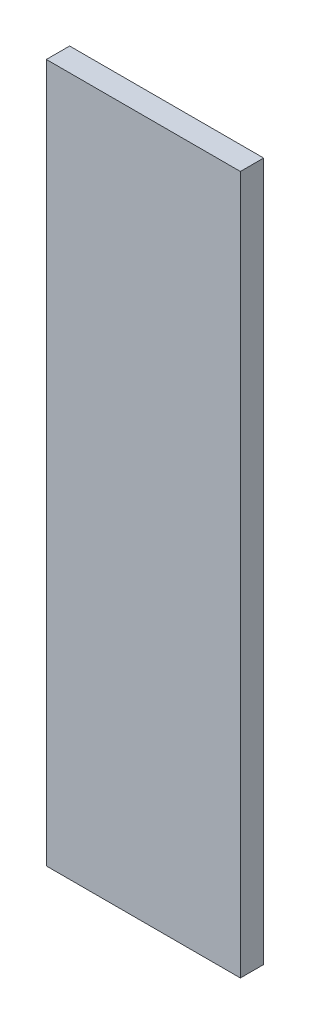
ISO-10303-21;
HEADER;
FILE_DESCRIPTION(('STEP AP214'),'2;1');
FILE_NAME('part.step','',(''),(''),'','','');
FILE_SCHEMA(('AUTOMOTIVE_DESIGN { 1 0 10303 214 1 1 1 1 }'));
ENDSEC;
DATA;
#1=APPLICATION_CONTEXT('core data for automotive mechanical design processes');
#2=APPLICATION_PROTOCOL_DEFINITION('international standard','automotive_design',2000,#1);
#3=PRODUCT_CONTEXT('',#1,'mechanical');
#4=PRODUCT('Part','Part','',(#3));
#5=PRODUCT_RELATED_PRODUCT_CATEGORY('part','',(#4));
#6=PRODUCT_DEFINITION_FORMATION('','',#4);
#7=PRODUCT_DEFINITION_CONTEXT('part definition',#1,'design');
#8=PRODUCT_DEFINITION('design','',#6,#7);
#9=PRODUCT_DEFINITION_SHAPE('','',#8);
#10=(LENGTH_UNIT() NAMED_UNIT(*) SI_UNIT(.MILLI.,.METRE.));
#11=(NAMED_UNIT(*) PLANE_ANGLE_UNIT() SI_UNIT($,.RADIAN.));
#12=(NAMED_UNIT(*) SI_UNIT($,.STERADIAN.) SOLID_ANGLE_UNIT());
#13=UNCERTAINTY_MEASURE_WITH_UNIT(LENGTH_MEASURE(1.E-05),#10,'distance_accuracy_value','');
#14=(GEOMETRIC_REPRESENTATION_CONTEXT(3) GLOBAL_UNCERTAINTY_ASSIGNED_CONTEXT((#13)) GLOBAL_UNIT_ASSIGNED_CONTEXT((#10,
#11,#12)) REPRESENTATION_CONTEXT('',''));
#15=CARTESIAN_POINT('',(0.,0.,0.));
#16=DIRECTION('',(0.,0.,1.));
#17=DIRECTION('',(1.,0.,0.));
#18=AXIS2_PLACEMENT_3D('',#15,#16,#17);
#19=CARTESIAN_POINT('',(-24.9999999999999,-89.9999999999998,6.));
#20=DIRECTION('',(1.,0.,0.));
#21=DIRECTION('',(0.,0.,-1.));
#22=AXIS2_PLACEMENT_3D('',#19,#20,#21);
#23=PLANE('',#22);
#24=DIRECTION('',(0.,-1.,0.));
#25=VECTOR('',#24,1.);
#26=CARTESIAN_POINT('',(-24.9999999999999,-89.9999999999998,0.));
#27=LINE('',#26,#25);
#28=CARTESIAN_POINT('',(-24.9999999999999,90.0000000000002,0.));
#29=VERTEX_POINT('',#28);
#30=CARTESIAN_POINT('',(-24.9999999999999,-89.9999999999998,0.));
#31=VERTEX_POINT('',#30);
#32=EDGE_CURVE('E96',#29,#31,#27,.T.);
#33=ORIENTED_EDGE('',*,*,#32,.T.);
#34=DIRECTION('',(0.,0.,-1.));
#35=VECTOR('',#34,1.);
#36=CARTESIAN_POINT('',(-24.9999999999999,-89.9999999999998,6.));
#37=LINE('',#36,#35);
#38=CARTESIAN_POINT('',(-24.9999999999999,-89.9999999999998,6.));
#39=VERTEX_POINT('',#38);
#40=EDGE_CURVE('E11',#39,#31,#37,.T.);
#41=ORIENTED_EDGE('',*,*,#40,.F.);
#42=DIRECTION('',(0.,-1.,0.));
#43=VECTOR('',#42,1.);
#44=CARTESIAN_POINT('',(-24.9999999999999,-89.9999999999998,6.));
#45=LINE('',#44,#43);
#46=CARTESIAN_POINT('',(-24.9999999999999,90.0000000000002,6.));
#47=VERTEX_POINT('',#46);
#48=EDGE_CURVE('E84',#47,#39,#45,.T.);
#49=ORIENTED_EDGE('',*,*,#48,.F.);
#50=DIRECTION('',(0.,0.,-1.));
#51=VECTOR('',#50,1.);
#52=CARTESIAN_POINT('',(-24.9999999999999,90.0000000000002,6.));
#53=LINE('',#52,#51);
#54=EDGE_CURVE('E92',#47,#29,#53,.T.);
#55=ORIENTED_EDGE('',*,*,#54,.T.);
#56=EDGE_LOOP('',(#33,#41,#49,#55));
#57=FACE_BOUND('',#56,.T.);
#58=ADVANCED_FACE('F33',(#57),#23,.F.);
#59=CARTESIAN_POINT('',(25.0000000000001,-89.9999999999998,6.));
#60=DIRECTION('',(0.,1.,0.));
#61=DIRECTION('',(0.,0.,1.));
#62=AXIS2_PLACEMENT_3D('',#59,#60,#61);
#63=PLANE('',#62);
#64=DIRECTION('',(1.,0.,0.));
#65=VECTOR('',#64,1.);
#66=CARTESIAN_POINT('',(25.0000000000001,-89.9999999999998,0.));
#67=LINE('',#66,#65);
#68=CARTESIAN_POINT('',(25.0000000000001,-89.9999999999998,0.));
#69=VERTEX_POINT('',#68);
#70=EDGE_CURVE('E88',#31,#69,#67,.T.);
#71=ORIENTED_EDGE('',*,*,#70,.T.);
#72=DIRECTION('',(0.,0.,-1.));
#73=VECTOR('',#72,1.);
#74=CARTESIAN_POINT('',(25.0000000000001,-89.9999999999998,6.));
#75=LINE('',#74,#73);
#76=CARTESIAN_POINT('',(25.0000000000001,-89.9999999999998,6.));
#77=VERTEX_POINT('',#76);
#78=EDGE_CURVE('E41',#77,#69,#75,.T.);
#79=ORIENTED_EDGE('',*,*,#78,.F.);
#80=DIRECTION('',(1.,0.,0.));
#81=VECTOR('',#80,1.);
#82=CARTESIAN_POINT('',(25.0000000000001,-89.9999999999998,6.));
#83=LINE('',#82,#81);
#84=EDGE_CURVE('E79',#39,#77,#83,.T.);
#85=ORIENTED_EDGE('',*,*,#84,.F.);
#86=ORIENTED_EDGE('',*,*,#40,.T.);
#87=EDGE_LOOP('',(#71,#79,#85,#86));
#88=FACE_BOUND('',#87,.T.);
#89=ADVANCED_FACE('F87',(#88),#63,.F.);
#90=CARTESIAN_POINT('',(25.0000000000001,-89.9999999999998,6.));
#91=DIRECTION('',(-1.,0.,0.));
#92=DIRECTION('',(0.,0.,1.));
#93=AXIS2_PLACEMENT_3D('',#90,#91,#92);
#94=PLANE('',#93);
#95=DIRECTION('',(0.,1.,0.));
#96=VECTOR('',#95,1.);
#97=CARTESIAN_POINT('',(25.0000000000001,-89.9999999999998,0.));
#98=LINE('',#97,#96);
#99=CARTESIAN_POINT('',(25.0000000000001,90.0000000000002,0.));
#100=VERTEX_POINT('',#99);
#101=EDGE_CURVE('E66',#69,#100,#98,.T.);
#102=ORIENTED_EDGE('',*,*,#101,.T.);
#103=DIRECTION('',(0.,0.,-1.));
#104=VECTOR('',#103,1.);
#105=CARTESIAN_POINT('',(25.0000000000001,90.0000000000002,6.));
#106=LINE('',#105,#104);
#107=CARTESIAN_POINT('',(25.0000000000001,90.0000000000002,6.));
#108=VERTEX_POINT('',#107);
#109=EDGE_CURVE('E89',#108,#100,#106,.T.);
#110=ORIENTED_EDGE('',*,*,#109,.F.);
#111=DIRECTION('',(0.,1.,0.));
#112=VECTOR('',#111,1.);
#113=CARTESIAN_POINT('',(25.0000000000001,-89.9999999999998,6.));
#114=LINE('',#113,#112);
#115=EDGE_CURVE('E82',#77,#108,#114,.T.);
#116=ORIENTED_EDGE('',*,*,#115,.F.);
#117=ORIENTED_EDGE('',*,*,#78,.T.);
#118=EDGE_LOOP('',(#102,#110,#116,#117));
#119=FACE_BOUND('',#118,.T.);
#120=ADVANCED_FACE('F90',(#119),#94,.F.);
#121=CARTESIAN_POINT('',(25.0000000000001,90.0000000000002,6.));
#122=DIRECTION('',(0.,-1.,0.));
#123=DIRECTION('',(0.,0.,-1.));
#124=AXIS2_PLACEMENT_3D('',#121,#122,#123);
#125=PLANE('',#124);
#126=DIRECTION('',(-1.,0.,0.));
#127=VECTOR('',#126,1.);
#128=CARTESIAN_POINT('',(25.0000000000001,90.0000000000002,0.));
#129=LINE('',#128,#127);
#130=EDGE_CURVE('E72',#100,#29,#129,.T.);
#131=ORIENTED_EDGE('',*,*,#130,.T.);
#132=ORIENTED_EDGE('',*,*,#54,.F.);
#133=DIRECTION('',(-1.,0.,0.));
#134=VECTOR('',#133,1.);
#135=CARTESIAN_POINT('',(25.0000000000001,90.0000000000002,6.));
#136=LINE('',#135,#134);
#137=EDGE_CURVE('E49',#108,#47,#136,.T.);
#138=ORIENTED_EDGE('',*,*,#137,.F.);
#139=ORIENTED_EDGE('',*,*,#109,.T.);
#140=EDGE_LOOP('',(#131,#132,#138,#139));
#141=FACE_BOUND('',#140,.T.);
#142=ADVANCED_FACE('F103',(#141),#125,.F.);
#143=CARTESIAN_POINT('',(0.,0.,6.));
#144=DIRECTION('',(0.,0.,1.));
#145=DIRECTION('',(1.,0.,0.));
#146=AXIS2_PLACEMENT_3D('',#143,#144,#145);
#147=PLANE('',#146);
#148=ORIENTED_EDGE('',*,*,#48,.T.);
#149=ORIENTED_EDGE('',*,*,#84,.T.);
#150=ORIENTED_EDGE('',*,*,#115,.T.);
#151=ORIENTED_EDGE('',*,*,#137,.T.);
#152=EDGE_LOOP('',(#148,#149,#150,#151));
#153=FACE_BOUND('',#152,.T.);
#154=ADVANCED_FACE('F80',(#153),#147,.T.);
#155=CARTESIAN_POINT('',(0.,0.,0.));
#156=DIRECTION('',(0.,0.,1.));
#157=DIRECTION('',(1.,0.,0.));
#158=AXIS2_PLACEMENT_3D('',#155,#156,#157);
#159=PLANE('',#158);
#160=ORIENTED_EDGE('',*,*,#32,.F.);
#161=ORIENTED_EDGE('',*,*,#130,.F.);
#162=ORIENTED_EDGE('',*,*,#101,.F.);
#163=ORIENTED_EDGE('',*,*,#70,.F.);
#164=EDGE_LOOP('',(#160,#161,#162,#163));
#165=FACE_BOUND('',#164,.T.);
#166=ADVANCED_FACE('F106',(#165),#159,.F.);
#167=CLOSED_SHELL('',(#58,#89,#120,#142,#154,#166));
#168=MANIFOLD_SOLID_BREP('B2',#167);
#169=ADVANCED_BREP_SHAPE_REPRESENTATION('',(#18,#168),#14);
#170=SHAPE_DEFINITION_REPRESENTATION(#9,#169);
ENDSEC;
END-ISO-10303-21;
